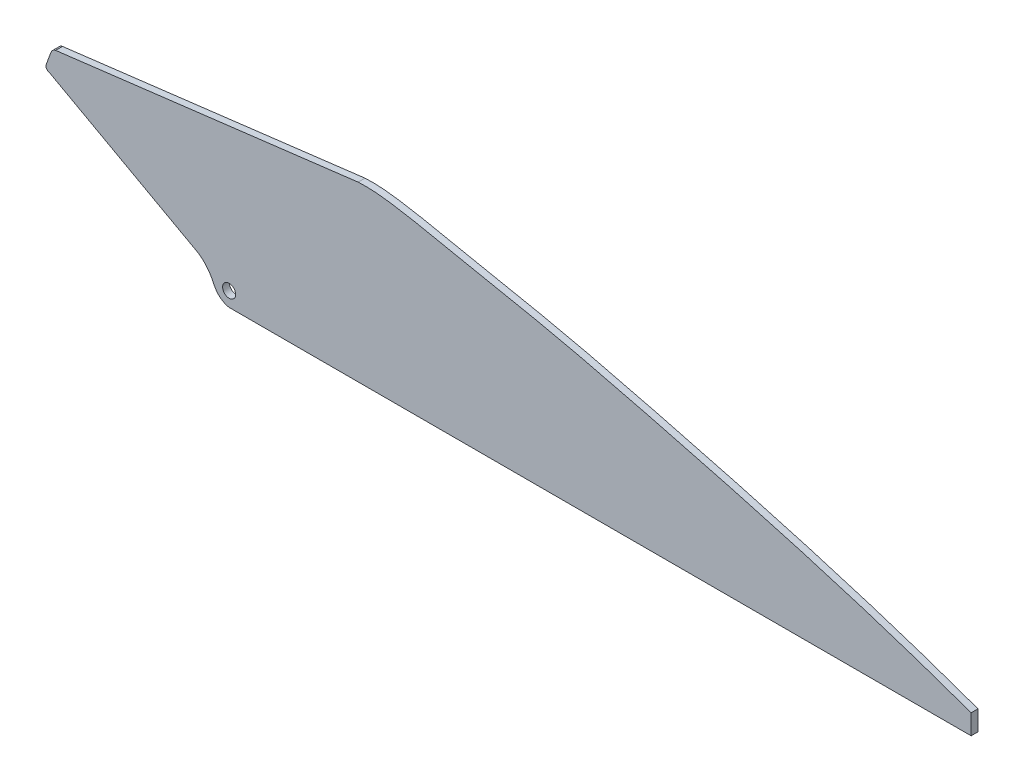
ISO-10303-21;
HEADER;
FILE_DESCRIPTION(('STEP AP214'),'2;1');
FILE_NAME('part.step','',(''),(''),'','','');
FILE_SCHEMA(('AUTOMOTIVE_DESIGN { 1 0 10303 214 1 1 1 1 }'));
ENDSEC;
DATA;
#1=APPLICATION_CONTEXT('core data for automotive mechanical design processes');
#2=APPLICATION_PROTOCOL_DEFINITION('international standard','automotive_design',2000,#1);
#3=PRODUCT_CONTEXT('',#1,'mechanical');
#4=PRODUCT('Part','Part','',(#3));
#5=PRODUCT_RELATED_PRODUCT_CATEGORY('part','',(#4));
#6=PRODUCT_DEFINITION_FORMATION('','',#4);
#7=PRODUCT_DEFINITION_CONTEXT('part definition',#1,'design');
#8=PRODUCT_DEFINITION('design','',#6,#7);
#9=PRODUCT_DEFINITION_SHAPE('','',#8);
#10=(LENGTH_UNIT() NAMED_UNIT(*) SI_UNIT(.MILLI.,.METRE.));
#11=(NAMED_UNIT(*) PLANE_ANGLE_UNIT() SI_UNIT($,.RADIAN.));
#12=(NAMED_UNIT(*) SI_UNIT($,.STERADIAN.) SOLID_ANGLE_UNIT());
#13=UNCERTAINTY_MEASURE_WITH_UNIT(LENGTH_MEASURE(1.E-05),#10,'distance_accuracy_value','');
#14=(GEOMETRIC_REPRESENTATION_CONTEXT(3) GLOBAL_UNCERTAINTY_ASSIGNED_CONTEXT((#13)) GLOBAL_UNIT_ASSIGNED_CONTEXT((#10,
#11,#12)) REPRESENTATION_CONTEXT('',''));
#15=CARTESIAN_POINT('',(0.,0.,0.));
#16=DIRECTION('',(0.,0.,1.));
#17=DIRECTION('',(1.,0.,0.));
#18=AXIS2_PLACEMENT_3D('',#15,#16,#17);
#19=CARTESIAN_POINT('',(-7.68794033131096,-19.8363837658501,6.5532));
#20=DIRECTION('',(0.,0.,1.));
#21=DIRECTION('',(1.,0.,0.));
#22=AXIS2_PLACEMENT_3D('',#19,#20,#21);
#23=PLANE('',#22);
#24=CARTESIAN_POINT('',(-21.7608543107346,-3.49280632910894,6.5532));
#25=CARTESIAN_POINT('',(-15.5240395902227,-7.58967485460209,6.5532));
#26=CARTESIAN_POINT('',(-9.83343931623149,-14.720767687426,6.5532));
#27=CARTESIAN_POINT('',(-4.01754193931812,-28.0232807361721,6.5532));
#28=CARTESIAN_POINT('',(2.08106373113456,-32.902187390798,6.5532));
#29=CARTESIAN_POINT('',(7.86341358084366,-33.8695032211617,6.5532));
#30=B_SPLINE_CURVE_WITH_KNOTS('',3,(#24,#25,#26,#27,#28,#29),.UNSPECIFIED.,.F.,.F.,(4,1,1,4),
(0.,0.506293100521807,0.61182822907039,1.),.UNSPECIFIED.);
#31=CARTESIAN_POINT('',(-21.7608543107346,-3.49280632910894,6.5532));
#32=VERTEX_POINT('',#31);
#33=CARTESIAN_POINT('',(7.86341358084365,-33.8695032211617,6.5532));
#34=VERTEX_POINT('',#33);
#35=EDGE_CURVE('E217',#32,#34,#30,.T.);
#36=ORIENTED_EDGE('',*,*,#35,.T.);
#37=DIRECTION('',(1.,0.,0.));
#38=VECTOR('',#37,1.);
#39=CARTESIAN_POINT('',(7.86341358084365,-33.8695032211617,6.5532));
#40=LINE('',#39,#38);
#41=CARTESIAN_POINT('',(715.888413580844,-33.8695032211617,6.5532));
#42=VERTEX_POINT('',#41);
#43=EDGE_CURVE('E100',#34,#42,#40,.T.);
#44=ORIENTED_EDGE('',*,*,#43,.T.);
#45=DIRECTION('',(0.,1.,0.));
#46=VECTOR('',#45,1.);
#47=CARTESIAN_POINT('',(715.888413580844,-33.8695032211617,6.5532));
#48=LINE('',#47,#46);
#49=CARTESIAN_POINT('',(715.888413580844,-14.8195032211617,6.5532));
#50=VERTEX_POINT('',#49);
#51=EDGE_CURVE('E174',#42,#50,#48,.T.);
#52=ORIENTED_EDGE('',*,*,#51,.T.);
#53=CARTESIAN_POINT('',(715.888413580844,-14.8195032211617,6.5532));
#54=CARTESIAN_POINT('',(612.695452819801,22.7298617011383,6.5532));
#55=CARTESIAN_POINT('',(477.935660390498,59.8554938163913,6.5532));
#56=CARTESIAN_POINT('',(312.791548306165,100.51997418757,6.5532));
#57=CARTESIAN_POINT('',(235.979768818263,114.851503420216,6.5532));
#58=CARTESIAN_POINT('',(175.745486699131,127.859730287955,6.5532));
#59=CARTESIAN_POINT('',(144.565200567757,132.032600728102,6.5532));
#60=CARTESIAN_POINT('',(130.923235961952,131.230496778838,6.5532));
#61=B_SPLINE_CURVE_WITH_KNOTS('',3,(#53,#54,#55,#56,#57,#58,#59,#60),.UNSPECIFIED.,.F.,.F.,(4,1,
1,1,1,4),(0.,0.544611450111637,0.693829764634689,0.844415441331758,0.932440948422418,1.),.UNSPECIFIED.);
#62=CARTESIAN_POINT('',(130.923235961952,131.230496778838,6.5532));
#63=VERTEX_POINT('',#62);
#64=EDGE_CURVE('E169',#50,#63,#61,.T.);
#65=ORIENTED_EDGE('',*,*,#64,.T.);
#66=DIRECTION('',(-0.992535618791596,-0.121955095957421,0.));
#67=VECTOR('',#66,1.);
#68=CARTESIAN_POINT('',(-157.661182160782,95.7714767319573,6.5532));
#69=LINE('',#68,#67);
#70=CARTESIAN_POINT('',(-157.661182160782,95.7714767319573,6.5532));
#71=VERTEX_POINT('',#70);
#72=EDGE_CURVE('E164',#63,#71,#69,.T.);
#73=ORIENTED_EDGE('',*,*,#72,.T.);
#74=CARTESIAN_POINT('',(-157.661182160782,95.7714767319573,6.5532));
#75=CARTESIAN_POINT('',(-160.791359706022,95.0159114037611,6.5532));
#76=CARTESIAN_POINT('',(-162.045338663385,92.0760438458558,6.5532));
#77=B_SPLINE_CURVE_WITH_KNOTS('',2,(#74,#75,#76),.UNSPECIFIED.,.F.,.F.,(3,3),(0.,1.),.UNSPECIFIED.);
#78=CARTESIAN_POINT('',(-162.045338663385,92.0760438458558,6.5532));
#79=VERTEX_POINT('',#78);
#80=EDGE_CURVE('E122',#71,#79,#77,.T.);
#81=ORIENTED_EDGE('',*,*,#80,.T.);
#82=DIRECTION('',(-0.349313736853362,-0.937005823485393,0.));
#83=VECTOR('',#82,1.);
#84=CARTESIAN_POINT('',(-166.007371821553,81.4482106106451,6.5532));
#85=LINE('',#84,#83);
#86=CARTESIAN_POINT('',(-166.007371821553,81.4482106106451,6.5532));
#87=VERTEX_POINT('',#86);
#88=EDGE_CURVE('E116',#79,#87,#85,.T.);
#89=ORIENTED_EDGE('',*,*,#88,.T.);
#90=CARTESIAN_POINT('',(-166.007371821553,81.4482106106451,6.5532));
#91=CARTESIAN_POINT('',(-168.608963638138,75.8606687432468,6.5532));
#92=CARTESIAN_POINT('',(-163.225353361825,74.2452075356679,6.5532));
#93=B_SPLINE_CURVE_WITH_KNOTS('',2,(#90,#91,#92),.UNSPECIFIED.,.F.,.F.,(3,3),(0.,1.),.UNSPECIFIED.);
#94=CARTESIAN_POINT('',(-163.225353361825,74.2452075356679,6.5532));
#95=VERTEX_POINT('',#94);
#96=EDGE_CURVE('E120',#87,#95,#93,.T.);
#97=ORIENTED_EDGE('',*,*,#96,.T.);
#98=DIRECTION('',(0.876392326207858,-0.481597851494356,0.));
#99=VECTOR('',#98,1.);
#100=CARTESIAN_POINT('',(-163.225353361825,74.2452075356679,6.5532));
#101=LINE('',#100,#99);
#102=EDGE_CURVE('E54',#95,#32,#101,.T.);
#103=ORIENTED_EDGE('',*,*,#102,.T.);
#104=EDGE_LOOP('',(#36,#44,#52,#65,#73,#81,#89,#97,#103));
#105=FACE_BOUND('',#104,.T.);
#106=CARTESIAN_POINT('',(7.86341358084365,-20.0818400243319,6.5532));
#107=DIRECTION('',(0.,0.,1.));
#108=DIRECTION('',(1.,0.,0.));
#109=AXIS2_PLACEMENT_3D('',#106,#107,#108);
#110=CIRCLE('',#109,6.223);
#111=CARTESIAN_POINT('',(14.0864135808437,-20.0818400243319,6.5532));
#112=VERTEX_POINT('',#111);
#113=EDGE_CURVE('E209',#112,#112,#110,.T.);
#114=ORIENTED_EDGE('',*,*,#113,.F.);
#115=EDGE_LOOP('',(#114));
#116=FACE_BOUND('',#115,.T.);
#117=ADVANCED_FACE('F36',(#105,#116),#23,.T.);
#118=CARTESIAN_POINT('',(-7.68794033131096,-19.8363837658501,0.));
#119=DIRECTION('',(0.,0.,1.));
#120=DIRECTION('',(1.,0.,0.));
#121=AXIS2_PLACEMENT_3D('',#118,#119,#120);
#122=PLANE('',#121);
#123=CARTESIAN_POINT('',(-21.7608543107346,-3.49280632910894,0.));
#124=CARTESIAN_POINT('',(-15.5240395902227,-7.58967485460209,0.));
#125=CARTESIAN_POINT('',(-9.83343931623149,-14.720767687426,0.));
#126=CARTESIAN_POINT('',(-4.01754193931812,-28.0232807361721,0.));
#127=CARTESIAN_POINT('',(2.08106373113456,-32.902187390798,0.));
#128=CARTESIAN_POINT('',(7.86341358084366,-33.8695032211617,0.));
#129=B_SPLINE_CURVE_WITH_KNOTS('',3,(#123,#124,#125,#126,#127,#128),.UNSPECIFIED.,.F.,.F.,(4,1,
1,4),(0.,0.506293100521807,0.61182822907039,1.),.UNSPECIFIED.);
#130=CARTESIAN_POINT('',(-21.7608543107346,-3.49280632910894,0.));
#131=VERTEX_POINT('',#130);
#132=CARTESIAN_POINT('',(7.86341358084365,-33.8695032211617,0.));
#133=VERTEX_POINT('',#132);
#134=EDGE_CURVE('E215',#131,#133,#129,.T.);
#135=ORIENTED_EDGE('',*,*,#134,.F.);
#136=DIRECTION('',(0.876392326207858,-0.481597851494356,0.));
#137=VECTOR('',#136,1.);
#138=CARTESIAN_POINT('',(-163.225353361825,74.2452075356679,0.));
#139=LINE('',#138,#137);
#140=CARTESIAN_POINT('',(-163.225353361825,74.2452075356679,0.));
#141=VERTEX_POINT('',#140);
#142=EDGE_CURVE('E92',#141,#131,#139,.T.);
#143=ORIENTED_EDGE('',*,*,#142,.F.);
#144=CARTESIAN_POINT('',(-166.007371821553,81.4482106106451,0.));
#145=CARTESIAN_POINT('',(-168.608963638138,75.8606687432468,0.));
#146=CARTESIAN_POINT('',(-163.225353361825,74.2452075356679,0.));
#147=B_SPLINE_CURVE_WITH_KNOTS('',2,(#144,#145,#146),.UNSPECIFIED.,.F.,.F.,(3,3),(0.,1.),.UNSPECIFIED.);
#148=CARTESIAN_POINT('',(-166.007371821553,81.4482106106451,0.));
#149=VERTEX_POINT('',#148);
#150=EDGE_CURVE('E86',#149,#141,#147,.T.);
#151=ORIENTED_EDGE('',*,*,#150,.F.);
#152=DIRECTION('',(-0.349313736853362,-0.937005823485393,0.));
#153=VECTOR('',#152,1.);
#154=CARTESIAN_POINT('',(-166.007371821553,81.4482106106451,0.));
#155=LINE('',#154,#153);
#156=CARTESIAN_POINT('',(-162.045338663385,92.0760438458558,0.));
#157=VERTEX_POINT('',#156);
#158=EDGE_CURVE('E130',#157,#149,#155,.T.);
#159=ORIENTED_EDGE('',*,*,#158,.F.);
#160=CARTESIAN_POINT('',(-157.661182160782,95.7714767319573,0.));
#161=CARTESIAN_POINT('',(-160.791359706022,95.0159114037611,0.));
#162=CARTESIAN_POINT('',(-162.045338663385,92.0760438458558,0.));
#163=B_SPLINE_CURVE_WITH_KNOTS('',2,(#160,#161,#162),.UNSPECIFIED.,.F.,.F.,(3,3),(0.,1.),.UNSPECIFIED.);
#164=CARTESIAN_POINT('',(-157.661182160782,95.7714767319573,0.));
#165=VERTEX_POINT('',#164);
#166=EDGE_CURVE('E248',#165,#157,#163,.T.);
#167=ORIENTED_EDGE('',*,*,#166,.F.);
#168=DIRECTION('',(-0.992535618791596,-0.121955095957421,0.));
#169=VECTOR('',#168,1.);
#170=CARTESIAN_POINT('',(-157.661182160782,95.7714767319573,0.));
#171=LINE('',#170,#169);
#172=CARTESIAN_POINT('',(130.923235961952,131.230496778838,0.));
#173=VERTEX_POINT('',#172);
#174=EDGE_CURVE('E245',#173,#165,#171,.T.);
#175=ORIENTED_EDGE('',*,*,#174,.F.);
#176=CARTESIAN_POINT('',(715.888413580844,-14.8195032211617,0.));
#177=CARTESIAN_POINT('',(612.695452819801,22.7298617011383,0.));
#178=CARTESIAN_POINT('',(477.935660390498,59.8554938163913,0.));
#179=CARTESIAN_POINT('',(312.791548306165,100.51997418757,0.));
#180=CARTESIAN_POINT('',(235.979768818263,114.851503420216,0.));
#181=CARTESIAN_POINT('',(175.745486699131,127.859730287955,0.));
#182=CARTESIAN_POINT('',(144.565200567757,132.032600728102,0.));
#183=CARTESIAN_POINT('',(130.923235961952,131.230496778838,0.));
#184=B_SPLINE_CURVE_WITH_KNOTS('',3,(#176,#177,#178,#179,#180,#181,#182,#183),.UNSPECIFIED.,.F.,
.F.,(4,1,1,1,1,4),(0.,0.544611450111637,0.693829764634689,0.844415441331758,0.932440948422418,
1.),.UNSPECIFIED.);
#185=CARTESIAN_POINT('',(715.888413580844,-14.8195032211617,0.));
#186=VERTEX_POINT('',#185);
#187=EDGE_CURVE('E238',#186,#173,#184,.T.);
#188=ORIENTED_EDGE('',*,*,#187,.F.);
#189=DIRECTION('',(0.,1.,0.));
#190=VECTOR('',#189,1.);
#191=CARTESIAN_POINT('',(715.888413580844,-33.8695032211617,0.));
#192=LINE('',#191,#190);
#193=CARTESIAN_POINT('',(715.888413580844,-33.8695032211617,0.));
#194=VERTEX_POINT('',#193);
#195=EDGE_CURVE('E232',#194,#186,#192,.T.);
#196=ORIENTED_EDGE('',*,*,#195,.F.);
#197=DIRECTION('',(1.,0.,0.));
#198=VECTOR('',#197,1.);
#199=CARTESIAN_POINT('',(7.86341358084365,-33.8695032211617,0.));
#200=LINE('',#199,#198);
#201=EDGE_CURVE('E252',#133,#194,#200,.T.);
#202=ORIENTED_EDGE('',*,*,#201,.F.);
#203=EDGE_LOOP('',(#135,#143,#151,#159,#167,#175,#188,#196,#202));
#204=FACE_BOUND('',#203,.T.);
#205=CARTESIAN_POINT('',(7.86341358084365,-20.0818400243319,0.));
#206=DIRECTION('',(0.,0.,1.));
#207=DIRECTION('',(1.,0.,0.));
#208=AXIS2_PLACEMENT_3D('',#205,#206,#207);
#209=CIRCLE('',#208,6.223);
#210=CARTESIAN_POINT('',(14.0864135808437,-20.0818400243319,0.));
#211=VERTEX_POINT('',#210);
#212=EDGE_CURVE('E212',#211,#211,#209,.T.);
#213=ORIENTED_EDGE('',*,*,#212,.T.);
#214=EDGE_LOOP('',(#213));
#215=FACE_BOUND('',#214,.T.);
#216=ADVANCED_FACE('F191',(#204,#215),#122,.F.);
#217=DIRECTION('',(0.,0.,-1.));
#218=VECTOR('',#217,1.);
#219=SURFACE_OF_LINEAR_EXTRUSION('',#30,#218);
#220=ORIENTED_EDGE('',*,*,#134,.T.);
#221=DIRECTION('',(0.,0.,-1.));
#222=VECTOR('',#221,1.);
#223=CARTESIAN_POINT('',(7.86341358084365,-33.8695032211617,6.5532));
#224=LINE('',#223,#222);
#225=EDGE_CURVE('E11',#34,#133,#224,.T.);
#226=ORIENTED_EDGE('',*,*,#225,.F.);
#227=ORIENTED_EDGE('',*,*,#35,.F.);
#228=DIRECTION('',(0.,0.,-1.));
#229=VECTOR('',#228,1.);
#230=CARTESIAN_POINT('',(-21.7608543107346,-3.49280632910894,6.5532));
#231=LINE('',#230,#229);
#232=EDGE_CURVE('E136',#32,#131,#231,.T.);
#233=ORIENTED_EDGE('',*,*,#232,.T.);
#234=EDGE_LOOP('',(#220,#226,#227,#233));
#235=FACE_BOUND('',#234,.T.);
#236=ADVANCED_FACE('F38',(#235),#219,.F.);
#237=CARTESIAN_POINT('',(7.86341358084365,-33.8695032211617,6.5532));
#238=DIRECTION('',(0.,1.,0.));
#239=DIRECTION('',(-1.,0.,0.));
#240=AXIS2_PLACEMENT_3D('',#237,#238,#239);
#241=PLANE('',#240);
#242=ORIENTED_EDGE('',*,*,#201,.T.);
#243=DIRECTION('',(0.,0.,-1.));
#244=VECTOR('',#243,1.);
#245=CARTESIAN_POINT('',(715.888413580844,-33.8695032211617,6.5532));
#246=LINE('',#245,#244);
#247=EDGE_CURVE('E46',#42,#194,#246,.T.);
#248=ORIENTED_EDGE('',*,*,#247,.F.);
#249=ORIENTED_EDGE('',*,*,#43,.F.);
#250=ORIENTED_EDGE('',*,*,#225,.T.);
#251=EDGE_LOOP('',(#242,#248,#249,#250));
#252=FACE_BOUND('',#251,.T.);
#253=ADVANCED_FACE('F185',(#252),#241,.F.);
#254=CARTESIAN_POINT('',(715.888413580844,-33.8695032211617,6.5532));
#255=DIRECTION('',(-1.,0.,0.));
#256=DIRECTION('',(0.,-1.,0.));
#257=AXIS2_PLACEMENT_3D('',#254,#255,#256);
#258=PLANE('',#257);
#259=ORIENTED_EDGE('',*,*,#195,.T.);
#260=DIRECTION('',(0.,0.,-1.));
#261=VECTOR('',#260,1.);
#262=CARTESIAN_POINT('',(715.888413580844,-14.8195032211617,6.5532));
#263=LINE('',#262,#261);
#264=EDGE_CURVE('E230',#50,#186,#263,.T.);
#265=ORIENTED_EDGE('',*,*,#264,.F.);
#266=ORIENTED_EDGE('',*,*,#51,.F.);
#267=ORIENTED_EDGE('',*,*,#247,.T.);
#268=EDGE_LOOP('',(#259,#265,#266,#267));
#269=FACE_BOUND('',#268,.T.);
#270=ADVANCED_FACE('F182',(#269),#258,.F.);
#271=DIRECTION('',(0.,0.,-1.));
#272=VECTOR('',#271,1.);
#273=SURFACE_OF_LINEAR_EXTRUSION('',#61,#272);
#274=ORIENTED_EDGE('',*,*,#187,.T.);
#275=DIRECTION('',(0.,0.,-1.));
#276=VECTOR('',#275,1.);
#277=CARTESIAN_POINT('',(130.923235961952,131.230496778838,6.5532));
#278=LINE('',#277,#276);
#279=EDGE_CURVE('E234',#63,#173,#278,.T.);
#280=ORIENTED_EDGE('',*,*,#279,.F.);
#281=ORIENTED_EDGE('',*,*,#64,.F.);
#282=ORIENTED_EDGE('',*,*,#264,.T.);
#283=EDGE_LOOP('',(#274,#280,#281,#282));
#284=FACE_BOUND('',#283,.T.);
#285=ADVANCED_FACE('F179',(#284),#273,.F.);
#286=CARTESIAN_POINT('',(-157.661182160782,95.7714767319573,6.5532));
#287=DIRECTION('',(0.121955095957421,-0.992535618791596,0.));
#288=DIRECTION('',(0.992535618791596,0.121955095957421,0.));
#289=AXIS2_PLACEMENT_3D('',#286,#287,#288);
#290=PLANE('',#289);
#291=ORIENTED_EDGE('',*,*,#174,.T.);
#292=DIRECTION('',(0.,0.,-1.));
#293=VECTOR('',#292,1.);
#294=CARTESIAN_POINT('',(-157.661182160782,95.7714767319573,6.5532));
#295=LINE('',#294,#293);
#296=EDGE_CURVE('E241',#71,#165,#295,.T.);
#297=ORIENTED_EDGE('',*,*,#296,.F.);
#298=ORIENTED_EDGE('',*,*,#72,.F.);
#299=ORIENTED_EDGE('',*,*,#279,.T.);
#300=EDGE_LOOP('',(#291,#297,#298,#299));
#301=FACE_BOUND('',#300,.T.);
#302=ADVANCED_FACE('F157',(#301),#290,.F.);
#303=DIRECTION('',(0.,0.,-1.));
#304=VECTOR('',#303,1.);
#305=SURFACE_OF_LINEAR_EXTRUSION('',#77,#304);
#306=ORIENTED_EDGE('',*,*,#166,.T.);
#307=DIRECTION('',(0.,0.,-1.));
#308=VECTOR('',#307,1.);
#309=CARTESIAN_POINT('',(-162.045338663385,92.0760438458558,6.5532));
#310=LINE('',#309,#308);
#311=EDGE_CURVE('E131',#79,#157,#310,.T.);
#312=ORIENTED_EDGE('',*,*,#311,.F.);
#313=ORIENTED_EDGE('',*,*,#80,.F.);
#314=ORIENTED_EDGE('',*,*,#296,.T.);
#315=EDGE_LOOP('',(#306,#312,#313,#314));
#316=FACE_BOUND('',#315,.T.);
#317=ADVANCED_FACE('F154',(#316),#305,.F.);
#318=CARTESIAN_POINT('',(-166.007371821553,81.4482106106451,6.5532));
#319=DIRECTION('',(0.937005823485393,-0.349313736853362,0.));
#320=DIRECTION('',(0.349313736853362,0.937005823485393,0.));
#321=AXIS2_PLACEMENT_3D('',#318,#319,#320);
#322=PLANE('',#321);
#323=ORIENTED_EDGE('',*,*,#158,.T.);
#324=DIRECTION('',(0.,0.,-1.));
#325=VECTOR('',#324,1.);
#326=CARTESIAN_POINT('',(-166.007371821553,81.4482106106451,6.5532));
#327=LINE('',#326,#325);
#328=EDGE_CURVE('E127',#87,#149,#327,.T.);
#329=ORIENTED_EDGE('',*,*,#328,.F.);
#330=ORIENTED_EDGE('',*,*,#88,.F.);
#331=ORIENTED_EDGE('',*,*,#311,.T.);
#332=EDGE_LOOP('',(#323,#329,#330,#331));
#333=FACE_BOUND('',#332,.T.);
#334=ADVANCED_FACE('F128',(#333),#322,.F.);
#335=DIRECTION('',(0.,0.,-1.));
#336=VECTOR('',#335,1.);
#337=SURFACE_OF_LINEAR_EXTRUSION('',#93,#336);
#338=ORIENTED_EDGE('',*,*,#150,.T.);
#339=DIRECTION('',(0.,0.,-1.));
#340=VECTOR('',#339,1.);
#341=CARTESIAN_POINT('',(-163.225353361825,74.2452075356679,6.5532));
#342=LINE('',#341,#340);
#343=EDGE_CURVE('E132',#95,#141,#342,.T.);
#344=ORIENTED_EDGE('',*,*,#343,.F.);
#345=ORIENTED_EDGE('',*,*,#96,.F.);
#346=ORIENTED_EDGE('',*,*,#328,.T.);
#347=EDGE_LOOP('',(#338,#344,#345,#346));
#348=FACE_BOUND('',#347,.T.);
#349=ADVANCED_FACE('F134',(#348),#337,.F.);
#350=CARTESIAN_POINT('',(-163.225353361825,74.2452075356679,6.5532));
#351=DIRECTION('',(0.481597851494356,0.876392326207858,0.));
#352=DIRECTION('',(-0.876392326207858,0.481597851494356,0.));
#353=AXIS2_PLACEMENT_3D('',#350,#351,#352);
#354=PLANE('',#353);
#355=ORIENTED_EDGE('',*,*,#142,.T.);
#356=ORIENTED_EDGE('',*,*,#232,.F.);
#357=ORIENTED_EDGE('',*,*,#102,.F.);
#358=ORIENTED_EDGE('',*,*,#343,.T.);
#359=EDGE_LOOP('',(#355,#356,#357,#358));
#360=FACE_BOUND('',#359,.T.);
#361=ADVANCED_FACE('F150',(#360),#354,.F.);
#362=CARTESIAN_POINT('',(7.86341358084365,-20.0818400243319,6.5532));
#363=DIRECTION('',(0.,0.,-1.));
#364=DIRECTION('',(-1.,0.,0.));
#365=AXIS2_PLACEMENT_3D('',#362,#363,#364);
#366=CYLINDRICAL_SURFACE('',#365,6.223);
#367=ORIENTED_EDGE('',*,*,#113,.T.);
#368=EDGE_LOOP('',(#367));
#369=FACE_BOUND('',#368,.T.);
#370=ORIENTED_EDGE('',*,*,#212,.F.);
#371=EDGE_LOOP('',(#370));
#372=FACE_BOUND('',#371,.T.);
#373=ADVANCED_FACE('F200',(#369,#372),#366,.F.);
#374=CLOSED_SHELL('',(#117,#216,#236,#253,#270,#285,#302,#317,#334,#349,#361,#373));
#375=MANIFOLD_SOLID_BREP('B2',#374);
#376=ADVANCED_BREP_SHAPE_REPRESENTATION('',(#18,#375),#14);
#377=SHAPE_DEFINITION_REPRESENTATION(#9,#376);
ENDSEC;
END-ISO-10303-21;
